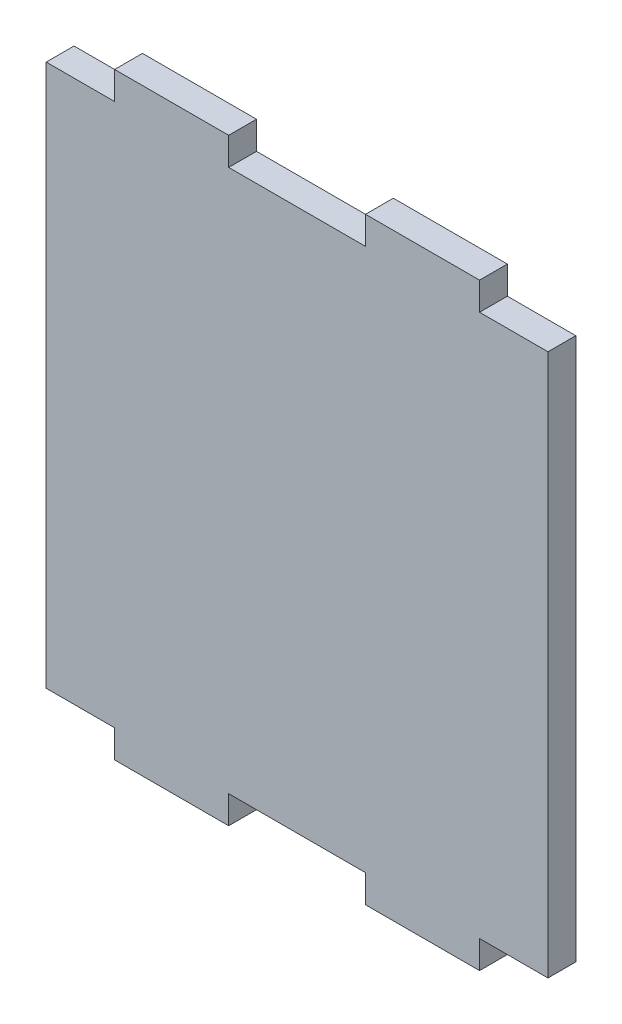
ISO-10303-21;
HEADER;
FILE_DESCRIPTION(('STEP AP214'),'2;1');
FILE_NAME('part.step','',(''),(''),'','','');
FILE_SCHEMA(('AUTOMOTIVE_DESIGN { 1 0 10303 214 1 1 1 1 }'));
ENDSEC;
DATA;
#1=APPLICATION_CONTEXT('core data for automotive mechanical design processes');
#2=APPLICATION_PROTOCOL_DEFINITION('international standard','automotive_design',2000,#1);
#3=PRODUCT_CONTEXT('',#1,'mechanical');
#4=PRODUCT('Part','Part','',(#3));
#5=PRODUCT_RELATED_PRODUCT_CATEGORY('part','',(#4));
#6=PRODUCT_DEFINITION_FORMATION('','',#4);
#7=PRODUCT_DEFINITION_CONTEXT('part definition',#1,'design');
#8=PRODUCT_DEFINITION('design','',#6,#7);
#9=PRODUCT_DEFINITION_SHAPE('','',#8);
#10=(LENGTH_UNIT() NAMED_UNIT(*) SI_UNIT(.MILLI.,.METRE.));
#11=(NAMED_UNIT(*) PLANE_ANGLE_UNIT() SI_UNIT($,.RADIAN.));
#12=(NAMED_UNIT(*) SI_UNIT($,.STERADIAN.) SOLID_ANGLE_UNIT());
#13=UNCERTAINTY_MEASURE_WITH_UNIT(LENGTH_MEASURE(1.E-05),#10,'distance_accuracy_value','');
#14=(GEOMETRIC_REPRESENTATION_CONTEXT(3) GLOBAL_UNCERTAINTY_ASSIGNED_CONTEXT((#13)) GLOBAL_UNIT_ASSIGNED_CONTEXT((#10,
#11,#12)) REPRESENTATION_CONTEXT('',''));
#15=CARTESIAN_POINT('',(0.,0.,0.));
#16=DIRECTION('',(0.,0.,1.));
#17=DIRECTION('',(1.,0.,0.));
#18=AXIS2_PLACEMENT_3D('',#15,#16,#17);
#19=CARTESIAN_POINT('',(16.,23.78,2.44));
#20=DIRECTION('',(0.,-1.,0.));
#21=DIRECTION('',(1.,0.,0.));
#22=AXIS2_PLACEMENT_3D('',#19,#20,#21);
#23=PLANE('',#22);
#24=DIRECTION('',(-1.,0.,0.));
#25=VECTOR('',#24,1.);
#26=CARTESIAN_POINT('',(16.,23.78,0.));
#27=LINE('',#26,#25);
#28=CARTESIAN_POINT('',(22.,23.78,0.));
#29=VERTEX_POINT('',#28);
#30=CARTESIAN_POINT('',(16.,23.78,0.));
#31=VERTEX_POINT('',#30);
#32=EDGE_CURVE('E205',#29,#31,#27,.T.);
#33=ORIENTED_EDGE('',*,*,#32,.T.);
#34=DIRECTION('',(0.,0.,-1.));
#35=VECTOR('',#34,1.);
#36=CARTESIAN_POINT('',(16.,23.78,2.44));
#37=LINE('',#36,#35);
#38=CARTESIAN_POINT('',(16.,23.78,2.44));
#39=VERTEX_POINT('',#38);
#40=EDGE_CURVE('E11',#39,#31,#37,.T.);
#41=ORIENTED_EDGE('',*,*,#40,.F.);
#42=DIRECTION('',(-1.,0.,0.));
#43=VECTOR('',#42,1.);
#44=CARTESIAN_POINT('',(16.,23.78,2.44));
#45=LINE('',#44,#43);
#46=CARTESIAN_POINT('',(22.,23.78,2.44));
#47=VERTEX_POINT('',#46);
#48=EDGE_CURVE('E243',#47,#39,#45,.T.);
#49=ORIENTED_EDGE('',*,*,#48,.F.);
#50=DIRECTION('',(0.,0.,-1.));
#51=VECTOR('',#50,1.);
#52=CARTESIAN_POINT('',(22.,23.78,2.44));
#53=LINE('',#52,#51);
#54=EDGE_CURVE('E201',#47,#29,#53,.T.);
#55=ORIENTED_EDGE('',*,*,#54,.T.);
#56=EDGE_LOOP('',(#33,#41,#49,#55));
#57=FACE_BOUND('',#56,.T.);
#58=ADVANCED_FACE('F37',(#57),#23,.F.);
#59=CARTESIAN_POINT('',(16.,23.78,2.44));
#60=DIRECTION('',(-1.,0.,0.));
#61=DIRECTION('',(0.,0.,1.));
#62=AXIS2_PLACEMENT_3D('',#59,#60,#61);
#63=PLANE('',#62);
#64=DIRECTION('',(0.,1.,0.));
#65=VECTOR('',#64,1.);
#66=CARTESIAN_POINT('',(16.,23.78,0.));
#67=LINE('',#66,#65);
#68=CARTESIAN_POINT('',(16.,26.22,0.));
#69=VERTEX_POINT('',#68);
#70=EDGE_CURVE('E208',#31,#69,#67,.T.);
#71=ORIENTED_EDGE('',*,*,#70,.T.);
#72=DIRECTION('',(0.,0.,-1.));
#73=VECTOR('',#72,1.);
#74=CARTESIAN_POINT('',(16.,26.22,2.44));
#75=LINE('',#74,#73);
#76=CARTESIAN_POINT('',(16.,26.22,2.44));
#77=VERTEX_POINT('',#76);
#78=EDGE_CURVE('E45',#77,#69,#75,.T.);
#79=ORIENTED_EDGE('',*,*,#78,.F.);
#80=DIRECTION('',(0.,1.,0.));
#81=VECTOR('',#80,1.);
#82=CARTESIAN_POINT('',(16.,23.78,2.44));
#83=LINE('',#82,#81);
#84=EDGE_CURVE('E132',#39,#77,#83,.T.);
#85=ORIENTED_EDGE('',*,*,#84,.F.);
#86=ORIENTED_EDGE('',*,*,#40,.T.);
#87=EDGE_LOOP('',(#71,#79,#85,#86));
#88=FACE_BOUND('',#87,.T.);
#89=ADVANCED_FACE('F361',(#88),#63,.F.);
#90=CARTESIAN_POINT('',(6.,26.22,2.44));
#91=DIRECTION('',(0.,-1.,0.));
#92=DIRECTION('',(1.,0.,0.));
#93=AXIS2_PLACEMENT_3D('',#90,#91,#92);
#94=PLANE('',#93);
#95=DIRECTION('',(-1.,0.,0.));
#96=VECTOR('',#95,1.);
#97=CARTESIAN_POINT('',(6.,26.22,0.));
#98=LINE('',#97,#96);
#99=CARTESIAN_POINT('',(6.,26.22,0.));
#100=VERTEX_POINT('',#99);
#101=EDGE_CURVE('E210',#69,#100,#98,.T.);
#102=ORIENTED_EDGE('',*,*,#101,.T.);
#103=DIRECTION('',(0.,0.,-1.));
#104=VECTOR('',#103,1.);
#105=CARTESIAN_POINT('',(6.,26.22,2.44));
#106=LINE('',#105,#104);
#107=CARTESIAN_POINT('',(6.,26.22,2.44));
#108=VERTEX_POINT('',#107);
#109=EDGE_CURVE('E286',#108,#100,#106,.T.);
#110=ORIENTED_EDGE('',*,*,#109,.F.);
#111=DIRECTION('',(-1.,0.,0.));
#112=VECTOR('',#111,1.);
#113=CARTESIAN_POINT('',(6.,26.22,2.44));
#114=LINE('',#113,#112);
#115=EDGE_CURVE('E294',#77,#108,#114,.T.);
#116=ORIENTED_EDGE('',*,*,#115,.F.);
#117=ORIENTED_EDGE('',*,*,#78,.T.);
#118=EDGE_LOOP('',(#102,#110,#116,#117));
#119=FACE_BOUND('',#118,.T.);
#120=ADVANCED_FACE('F292',(#119),#94,.F.);
#121=CARTESIAN_POINT('',(6.,23.78,2.44));
#122=DIRECTION('',(1.,0.,0.));
#123=DIRECTION('',(0.,1.,0.));
#124=AXIS2_PLACEMENT_3D('',#121,#122,#123);
#125=PLANE('',#124);
#126=DIRECTION('',(0.,-1.,0.));
#127=VECTOR('',#126,1.);
#128=CARTESIAN_POINT('',(6.,23.78,0.));
#129=LINE('',#128,#127);
#130=CARTESIAN_POINT('',(6.,23.78,0.));
#131=VERTEX_POINT('',#130);
#132=EDGE_CURVE('E212',#100,#131,#129,.T.);
#133=ORIENTED_EDGE('',*,*,#132,.T.);
#134=DIRECTION('',(0.,0.,-1.));
#135=VECTOR('',#134,1.);
#136=CARTESIAN_POINT('',(6.,23.78,2.44));
#137=LINE('',#136,#135);
#138=CARTESIAN_POINT('',(6.,23.78,2.44));
#139=VERTEX_POINT('',#138);
#140=EDGE_CURVE('E283',#139,#131,#137,.T.);
#141=ORIENTED_EDGE('',*,*,#140,.F.);
#142=DIRECTION('',(0.,-1.,0.));
#143=VECTOR('',#142,1.);
#144=CARTESIAN_POINT('',(6.,23.78,2.44));
#145=LINE('',#144,#143);
#146=EDGE_CURVE('E312',#108,#139,#145,.T.);
#147=ORIENTED_EDGE('',*,*,#146,.F.);
#148=ORIENTED_EDGE('',*,*,#109,.T.);
#149=EDGE_LOOP('',(#133,#141,#147,#148));
#150=FACE_BOUND('',#149,.T.);
#151=ADVANCED_FACE('F303',(#150),#125,.F.);
#152=CARTESIAN_POINT('',(-6.00000000000002,23.78,2.44));
#153=DIRECTION('',(0.,-1.,0.));
#154=DIRECTION('',(0.,0.,-1.));
#155=AXIS2_PLACEMENT_3D('',#152,#153,#154);
#156=PLANE('',#155);
#157=DIRECTION('',(-1.,0.,0.));
#158=VECTOR('',#157,1.);
#159=CARTESIAN_POINT('',(-6.00000000000002,23.78,0.));
#160=LINE('',#159,#158);
#161=CARTESIAN_POINT('',(-6.00000000000002,23.78,0.));
#162=VERTEX_POINT('',#161);
#163=EDGE_CURVE('E214',#131,#162,#160,.T.);
#164=ORIENTED_EDGE('',*,*,#163,.T.);
#165=DIRECTION('',(0.,0.,-1.));
#166=VECTOR('',#165,1.);
#167=CARTESIAN_POINT('',(-6.00000000000002,23.78,2.44));
#168=LINE('',#167,#166);
#169=CARTESIAN_POINT('',(-6.00000000000002,23.78,2.44));
#170=VERTEX_POINT('',#169);
#171=EDGE_CURVE('E280',#170,#162,#168,.T.);
#172=ORIENTED_EDGE('',*,*,#171,.F.);
#173=DIRECTION('',(-1.,0.,0.));
#174=VECTOR('',#173,1.);
#175=CARTESIAN_POINT('',(-6.00000000000002,23.78,2.44));
#176=LINE('',#175,#174);
#177=EDGE_CURVE('E309',#139,#170,#176,.T.);
#178=ORIENTED_EDGE('',*,*,#177,.F.);
#179=ORIENTED_EDGE('',*,*,#140,.T.);
#180=EDGE_LOOP('',(#164,#172,#178,#179));
#181=FACE_BOUND('',#180,.T.);
#182=ADVANCED_FACE('F307',(#181),#156,.F.);
#183=CARTESIAN_POINT('',(-6.00000000000002,23.78,2.44));
#184=DIRECTION('',(-1.,0.,0.));
#185=DIRECTION('',(0.,-1.,0.));
#186=AXIS2_PLACEMENT_3D('',#183,#184,#185);
#187=PLANE('',#186);
#188=DIRECTION('',(0.,1.,0.));
#189=VECTOR('',#188,1.);
#190=CARTESIAN_POINT('',(-6.00000000000002,23.78,0.));
#191=LINE('',#190,#189);
#192=CARTESIAN_POINT('',(-6.00000000000002,26.22,0.));
#193=VERTEX_POINT('',#192);
#194=EDGE_CURVE('E216',#162,#193,#191,.T.);
#195=ORIENTED_EDGE('',*,*,#194,.T.);
#196=DIRECTION('',(0.,0.,-1.));
#197=VECTOR('',#196,1.);
#198=CARTESIAN_POINT('',(-6.00000000000002,26.22,2.44));
#199=LINE('',#198,#197);
#200=CARTESIAN_POINT('',(-6.00000000000002,26.22,2.44));
#201=VERTEX_POINT('',#200);
#202=EDGE_CURVE('E277',#201,#193,#199,.T.);
#203=ORIENTED_EDGE('',*,*,#202,.F.);
#204=DIRECTION('',(0.,1.,0.));
#205=VECTOR('',#204,1.);
#206=CARTESIAN_POINT('',(-6.00000000000002,23.78,2.44));
#207=LINE('',#206,#205);
#208=EDGE_CURVE('E311',#170,#201,#207,.T.);
#209=ORIENTED_EDGE('',*,*,#208,.F.);
#210=ORIENTED_EDGE('',*,*,#171,.T.);
#211=EDGE_LOOP('',(#195,#203,#209,#210));
#212=FACE_BOUND('',#211,.T.);
#213=ADVANCED_FACE('F374',(#212),#187,.F.);
#214=CARTESIAN_POINT('',(-6.00000000000002,26.22,2.44));
#215=DIRECTION('',(0.,-1.,0.));
#216=DIRECTION('',(1.,0.,0.));
#217=AXIS2_PLACEMENT_3D('',#214,#215,#216);
#218=PLANE('',#217);
#219=DIRECTION('',(-1.,0.,0.));
#220=VECTOR('',#219,1.);
#221=CARTESIAN_POINT('',(-6.00000000000002,26.22,0.));
#222=LINE('',#221,#220);
#223=CARTESIAN_POINT('',(-16.,26.22,0.));
#224=VERTEX_POINT('',#223);
#225=EDGE_CURVE('E218',#193,#224,#222,.T.);
#226=ORIENTED_EDGE('',*,*,#225,.T.);
#227=DIRECTION('',(0.,0.,-1.));
#228=VECTOR('',#227,1.);
#229=CARTESIAN_POINT('',(-16.,26.22,2.44));
#230=LINE('',#229,#228);
#231=CARTESIAN_POINT('',(-16.,26.22,2.44));
#232=VERTEX_POINT('',#231);
#233=EDGE_CURVE('E274',#232,#224,#230,.T.);
#234=ORIENTED_EDGE('',*,*,#233,.F.);
#235=DIRECTION('',(-1.,0.,0.));
#236=VECTOR('',#235,1.);
#237=CARTESIAN_POINT('',(-6.00000000000002,26.22,2.44));
#238=LINE('',#237,#236);
#239=EDGE_CURVE('E314',#201,#232,#238,.T.);
#240=ORIENTED_EDGE('',*,*,#239,.F.);
#241=ORIENTED_EDGE('',*,*,#202,.T.);
#242=EDGE_LOOP('',(#226,#234,#240,#241));
#243=FACE_BOUND('',#242,.T.);
#244=ADVANCED_FACE('F377',(#243),#218,.F.);
#245=CARTESIAN_POINT('',(-16.,23.78,2.44));
#246=DIRECTION('',(1.,0.,0.));
#247=DIRECTION('',(0.,0.,-1.));
#248=AXIS2_PLACEMENT_3D('',#245,#246,#247);
#249=PLANE('',#248);
#250=DIRECTION('',(0.,-1.,0.));
#251=VECTOR('',#250,1.);
#252=CARTESIAN_POINT('',(-16.,23.78,0.));
#253=LINE('',#252,#251);
#254=CARTESIAN_POINT('',(-16.,23.78,0.));
#255=VERTEX_POINT('',#254);
#256=EDGE_CURVE('E220',#224,#255,#253,.T.);
#257=ORIENTED_EDGE('',*,*,#256,.T.);
#258=DIRECTION('',(0.,0.,-1.));
#259=VECTOR('',#258,1.);
#260=CARTESIAN_POINT('',(-16.,23.78,2.44));
#261=LINE('',#260,#259);
#262=CARTESIAN_POINT('',(-16.,23.78,2.44));
#263=VERTEX_POINT('',#262);
#264=EDGE_CURVE('E271',#263,#255,#261,.T.);
#265=ORIENTED_EDGE('',*,*,#264,.F.);
#266=DIRECTION('',(0.,-1.,0.));
#267=VECTOR('',#266,1.);
#268=CARTESIAN_POINT('',(-16.,23.78,2.44));
#269=LINE('',#268,#267);
#270=EDGE_CURVE('E320',#232,#263,#269,.T.);
#271=ORIENTED_EDGE('',*,*,#270,.F.);
#272=ORIENTED_EDGE('',*,*,#233,.T.);
#273=EDGE_LOOP('',(#257,#265,#271,#272));
#274=FACE_BOUND('',#273,.T.);
#275=ADVANCED_FACE('F381',(#274),#249,.F.);
#276=CARTESIAN_POINT('',(-22.,23.78,2.44));
#277=DIRECTION('',(0.,-1.,0.));
#278=DIRECTION('',(1.,0.,0.));
#279=AXIS2_PLACEMENT_3D('',#276,#277,#278);
#280=PLANE('',#279);
#281=DIRECTION('',(-1.,0.,0.));
#282=VECTOR('',#281,1.);
#283=CARTESIAN_POINT('',(-22.,23.78,0.));
#284=LINE('',#283,#282);
#285=CARTESIAN_POINT('',(-22.,23.78,0.));
#286=VERTEX_POINT('',#285);
#287=EDGE_CURVE('E222',#255,#286,#284,.T.);
#288=ORIENTED_EDGE('',*,*,#287,.T.);
#289=DIRECTION('',(0.,0.,-1.));
#290=VECTOR('',#289,1.);
#291=CARTESIAN_POINT('',(-22.,23.78,2.44));
#292=LINE('',#291,#290);
#293=CARTESIAN_POINT('',(-22.,23.78,2.44));
#294=VERTEX_POINT('',#293);
#295=EDGE_CURVE('E268',#294,#286,#292,.T.);
#296=ORIENTED_EDGE('',*,*,#295,.F.);
#297=DIRECTION('',(-1.,0.,0.));
#298=VECTOR('',#297,1.);
#299=CARTESIAN_POINT('',(-22.,23.78,2.44));
#300=LINE('',#299,#298);
#301=EDGE_CURVE('E322',#263,#294,#300,.T.);
#302=ORIENTED_EDGE('',*,*,#301,.F.);
#303=ORIENTED_EDGE('',*,*,#264,.T.);
#304=EDGE_LOOP('',(#288,#296,#302,#303));
#305=FACE_BOUND('',#304,.T.);
#306=ADVANCED_FACE('F385',(#305),#280,.F.);
#307=CARTESIAN_POINT('',(-22.,-23.78,2.44));
#308=DIRECTION('',(1.,0.,0.));
#309=DIRECTION('',(0.,0.,-1.));
#310=AXIS2_PLACEMENT_3D('',#307,#308,#309);
#311=PLANE('',#310);
#312=DIRECTION('',(0.,-1.,0.));
#313=VECTOR('',#312,1.);
#314=CARTESIAN_POINT('',(-22.,-23.78,0.));
#315=LINE('',#314,#313);
#316=CARTESIAN_POINT('',(-22.,-23.78,0.));
#317=VERTEX_POINT('',#316);
#318=EDGE_CURVE('E224',#286,#317,#315,.T.);
#319=ORIENTED_EDGE('',*,*,#318,.T.);
#320=DIRECTION('',(0.,0.,-1.));
#321=VECTOR('',#320,1.);
#322=CARTESIAN_POINT('',(-22.,-23.78,2.44));
#323=LINE('',#322,#321);
#324=CARTESIAN_POINT('',(-22.,-23.78,2.44));
#325=VERTEX_POINT('',#324);
#326=EDGE_CURVE('E265',#325,#317,#323,.T.);
#327=ORIENTED_EDGE('',*,*,#326,.F.);
#328=DIRECTION('',(0.,-1.,0.));
#329=VECTOR('',#328,1.);
#330=CARTESIAN_POINT('',(-22.,-23.78,2.44));
#331=LINE('',#330,#329);
#332=EDGE_CURVE('E324',#294,#325,#331,.T.);
#333=ORIENTED_EDGE('',*,*,#332,.F.);
#334=ORIENTED_EDGE('',*,*,#295,.T.);
#335=EDGE_LOOP('',(#319,#327,#333,#334));
#336=FACE_BOUND('',#335,.T.);
#337=ADVANCED_FACE('F389',(#336),#311,.F.);
#338=CARTESIAN_POINT('',(-22.,-23.78,2.44));
#339=DIRECTION('',(0.,1.,0.));
#340=DIRECTION('',(0.,0.,1.));
#341=AXIS2_PLACEMENT_3D('',#338,#339,#340);
#342=PLANE('',#341);
#343=DIRECTION('',(1.,0.,0.));
#344=VECTOR('',#343,1.);
#345=CARTESIAN_POINT('',(-22.,-23.78,0.));
#346=LINE('',#345,#344);
#347=CARTESIAN_POINT('',(-16.,-23.78,0.));
#348=VERTEX_POINT('',#347);
#349=EDGE_CURVE('E226',#317,#348,#346,.T.);
#350=ORIENTED_EDGE('',*,*,#349,.T.);
#351=DIRECTION('',(0.,0.,-1.));
#352=VECTOR('',#351,1.);
#353=CARTESIAN_POINT('',(-16.,-23.78,2.44));
#354=LINE('',#353,#352);
#355=CARTESIAN_POINT('',(-16.,-23.78,2.44));
#356=VERTEX_POINT('',#355);
#357=EDGE_CURVE('E262',#356,#348,#354,.T.);
#358=ORIENTED_EDGE('',*,*,#357,.F.);
#359=DIRECTION('',(1.,0.,0.));
#360=VECTOR('',#359,1.);
#361=CARTESIAN_POINT('',(-22.,-23.78,2.44));
#362=LINE('',#361,#360);
#363=EDGE_CURVE('E326',#325,#356,#362,.T.);
#364=ORIENTED_EDGE('',*,*,#363,.F.);
#365=ORIENTED_EDGE('',*,*,#326,.T.);
#366=EDGE_LOOP('',(#350,#358,#364,#365));
#367=FACE_BOUND('',#366,.T.);
#368=ADVANCED_FACE('F393',(#367),#342,.F.);
#369=CARTESIAN_POINT('',(-16.,-23.78,2.44));
#370=DIRECTION('',(1.,0.,0.));
#371=DIRECTION('',(0.,0.,-1.));
#372=AXIS2_PLACEMENT_3D('',#369,#370,#371);
#373=PLANE('',#372);
#374=DIRECTION('',(0.,-1.,0.));
#375=VECTOR('',#374,1.);
#376=CARTESIAN_POINT('',(-16.,-23.78,0.));
#377=LINE('',#376,#375);
#378=CARTESIAN_POINT('',(-16.,-26.22,0.));
#379=VERTEX_POINT('',#378);
#380=EDGE_CURVE('E228',#348,#379,#377,.T.);
#381=ORIENTED_EDGE('',*,*,#380,.T.);
#382=DIRECTION('',(0.,0.,-1.));
#383=VECTOR('',#382,1.);
#384=CARTESIAN_POINT('',(-16.,-26.22,2.44));
#385=LINE('',#384,#383);
#386=CARTESIAN_POINT('',(-16.,-26.22,2.44));
#387=VERTEX_POINT('',#386);
#388=EDGE_CURVE('E259',#387,#379,#385,.T.);
#389=ORIENTED_EDGE('',*,*,#388,.F.);
#390=DIRECTION('',(0.,-1.,0.));
#391=VECTOR('',#390,1.);
#392=CARTESIAN_POINT('',(-16.,-23.78,2.44));
#393=LINE('',#392,#391);
#394=EDGE_CURVE('E328',#356,#387,#393,.T.);
#395=ORIENTED_EDGE('',*,*,#394,.F.);
#396=ORIENTED_EDGE('',*,*,#357,.T.);
#397=EDGE_LOOP('',(#381,#389,#395,#396));
#398=FACE_BOUND('',#397,.T.);
#399=ADVANCED_FACE('F397',(#398),#373,.F.);
#400=CARTESIAN_POINT('',(-6.00000000000002,-26.22,2.44));
#401=DIRECTION('',(0.,1.,0.));
#402=DIRECTION('',(-1.,0.,0.));
#403=AXIS2_PLACEMENT_3D('',#400,#401,#402);
#404=PLANE('',#403);
#405=DIRECTION('',(1.,0.,0.));
#406=VECTOR('',#405,1.);
#407=CARTESIAN_POINT('',(-6.00000000000002,-26.22,0.));
#408=LINE('',#407,#406);
#409=CARTESIAN_POINT('',(-6.00000000000002,-26.22,0.));
#410=VERTEX_POINT('',#409);
#411=EDGE_CURVE('E230',#379,#410,#408,.T.);
#412=ORIENTED_EDGE('',*,*,#411,.T.);
#413=DIRECTION('',(0.,0.,-1.));
#414=VECTOR('',#413,1.);
#415=CARTESIAN_POINT('',(-6.00000000000002,-26.22,2.44));
#416=LINE('',#415,#414);
#417=CARTESIAN_POINT('',(-6.00000000000002,-26.22,2.44));
#418=VERTEX_POINT('',#417);
#419=EDGE_CURVE('E256',#418,#410,#416,.T.);
#420=ORIENTED_EDGE('',*,*,#419,.F.);
#421=DIRECTION('',(1.,0.,0.));
#422=VECTOR('',#421,1.);
#423=CARTESIAN_POINT('',(-6.00000000000002,-26.22,2.44));
#424=LINE('',#423,#422);
#425=EDGE_CURVE('E330',#387,#418,#424,.T.);
#426=ORIENTED_EDGE('',*,*,#425,.F.);
#427=ORIENTED_EDGE('',*,*,#388,.T.);
#428=EDGE_LOOP('',(#412,#420,#426,#427));
#429=FACE_BOUND('',#428,.T.);
#430=ADVANCED_FACE('F401',(#429),#404,.F.);
#431=CARTESIAN_POINT('',(-6.00000000000002,-23.78,2.44));
#432=DIRECTION('',(-1.,0.,0.));
#433=DIRECTION('',(0.,-1.,0.));
#434=AXIS2_PLACEMENT_3D('',#431,#432,#433);
#435=PLANE('',#434);
#436=DIRECTION('',(0.,1.,0.));
#437=VECTOR('',#436,1.);
#438=CARTESIAN_POINT('',(-6.00000000000002,-23.78,0.));
#439=LINE('',#438,#437);
#440=CARTESIAN_POINT('',(-6.00000000000002,-23.78,0.));
#441=VERTEX_POINT('',#440);
#442=EDGE_CURVE('E232',#410,#441,#439,.T.);
#443=ORIENTED_EDGE('',*,*,#442,.T.);
#444=DIRECTION('',(0.,0.,-1.));
#445=VECTOR('',#444,1.);
#446=CARTESIAN_POINT('',(-6.00000000000002,-23.78,2.44));
#447=LINE('',#446,#445);
#448=CARTESIAN_POINT('',(-6.00000000000002,-23.78,2.44));
#449=VERTEX_POINT('',#448);
#450=EDGE_CURVE('E253',#449,#441,#447,.T.);
#451=ORIENTED_EDGE('',*,*,#450,.F.);
#452=DIRECTION('',(0.,1.,0.));
#453=VECTOR('',#452,1.);
#454=CARTESIAN_POINT('',(-6.00000000000002,-23.78,2.44));
#455=LINE('',#454,#453);
#456=EDGE_CURVE('E332',#418,#449,#455,.T.);
#457=ORIENTED_EDGE('',*,*,#456,.F.);
#458=ORIENTED_EDGE('',*,*,#419,.T.);
#459=EDGE_LOOP('',(#443,#451,#457,#458));
#460=FACE_BOUND('',#459,.T.);
#461=ADVANCED_FACE('F405',(#460),#435,.F.);
#462=CARTESIAN_POINT('',(-6.00000000000002,-23.78,2.44));
#463=DIRECTION('',(0.,1.,0.));
#464=DIRECTION('',(0.,0.,1.));
#465=AXIS2_PLACEMENT_3D('',#462,#463,#464);
#466=PLANE('',#465);
#467=DIRECTION('',(1.,0.,0.));
#468=VECTOR('',#467,1.);
#469=CARTESIAN_POINT('',(-6.00000000000002,-23.78,0.));
#470=LINE('',#469,#468);
#471=CARTESIAN_POINT('',(6.,-23.78,0.));
#472=VERTEX_POINT('',#471);
#473=EDGE_CURVE('E234',#441,#472,#470,.T.);
#474=ORIENTED_EDGE('',*,*,#473,.T.);
#475=DIRECTION('',(0.,0.,-1.));
#476=VECTOR('',#475,1.);
#477=CARTESIAN_POINT('',(6.,-23.78,2.44));
#478=LINE('',#477,#476);
#479=CARTESIAN_POINT('',(6.,-23.78,2.44));
#480=VERTEX_POINT('',#479);
#481=EDGE_CURVE('E250',#480,#472,#478,.T.);
#482=ORIENTED_EDGE('',*,*,#481,.F.);
#483=DIRECTION('',(1.,0.,0.));
#484=VECTOR('',#483,1.);
#485=CARTESIAN_POINT('',(-6.00000000000002,-23.78,2.44));
#486=LINE('',#485,#484);
#487=EDGE_CURVE('E334',#449,#480,#486,.T.);
#488=ORIENTED_EDGE('',*,*,#487,.F.);
#489=ORIENTED_EDGE('',*,*,#450,.T.);
#490=EDGE_LOOP('',(#474,#482,#488,#489));
#491=FACE_BOUND('',#490,.T.);
#492=ADVANCED_FACE('F409',(#491),#466,.F.);
#493=CARTESIAN_POINT('',(6.,-23.78,2.44));
#494=DIRECTION('',(1.,0.,0.));
#495=DIRECTION('',(0.,1.,0.));
#496=AXIS2_PLACEMENT_3D('',#493,#494,#495);
#497=PLANE('',#496);
#498=DIRECTION('',(0.,-1.,0.));
#499=VECTOR('',#498,1.);
#500=CARTESIAN_POINT('',(6.,-23.78,0.));
#501=LINE('',#500,#499);
#502=CARTESIAN_POINT('',(6.,-26.22,0.));
#503=VERTEX_POINT('',#502);
#504=EDGE_CURVE('E236',#472,#503,#501,.T.);
#505=ORIENTED_EDGE('',*,*,#504,.T.);
#506=DIRECTION('',(0.,0.,-1.));
#507=VECTOR('',#506,1.);
#508=CARTESIAN_POINT('',(6.,-26.22,2.44));
#509=LINE('',#508,#507);
#510=CARTESIAN_POINT('',(6.,-26.22,2.44));
#511=VERTEX_POINT('',#510);
#512=EDGE_CURVE('E247',#511,#503,#509,.T.);
#513=ORIENTED_EDGE('',*,*,#512,.F.);
#514=DIRECTION('',(0.,-1.,0.));
#515=VECTOR('',#514,1.);
#516=CARTESIAN_POINT('',(6.,-23.78,2.44));
#517=LINE('',#516,#515);
#518=EDGE_CURVE('E336',#480,#511,#517,.T.);
#519=ORIENTED_EDGE('',*,*,#518,.F.);
#520=ORIENTED_EDGE('',*,*,#481,.T.);
#521=EDGE_LOOP('',(#505,#513,#519,#520));
#522=FACE_BOUND('',#521,.T.);
#523=ADVANCED_FACE('F342',(#522),#497,.F.);
#524=CARTESIAN_POINT('',(6.,-26.22,2.44));
#525=DIRECTION('',(0.,1.,0.));
#526=DIRECTION('',(-1.,0.,0.));
#527=AXIS2_PLACEMENT_3D('',#524,#525,#526);
#528=PLANE('',#527);
#529=DIRECTION('',(1.,0.,0.));
#530=VECTOR('',#529,1.);
#531=CARTESIAN_POINT('',(6.,-26.22,0.));
#532=LINE('',#531,#530);
#533=CARTESIAN_POINT('',(16.,-26.22,0.));
#534=VERTEX_POINT('',#533);
#535=EDGE_CURVE('E238',#503,#534,#532,.T.);
#536=ORIENTED_EDGE('',*,*,#535,.T.);
#537=DIRECTION('',(0.,0.,-1.));
#538=VECTOR('',#537,1.);
#539=CARTESIAN_POINT('',(16.,-26.22,2.44));
#540=LINE('',#539,#538);
#541=CARTESIAN_POINT('',(16.,-26.22,2.44));
#542=VERTEX_POINT('',#541);
#543=EDGE_CURVE('E196',#542,#534,#540,.T.);
#544=ORIENTED_EDGE('',*,*,#543,.F.);
#545=DIRECTION('',(1.,0.,0.));
#546=VECTOR('',#545,1.);
#547=CARTESIAN_POINT('',(6.,-26.22,2.44));
#548=LINE('',#547,#546);
#549=EDGE_CURVE('E187',#511,#542,#548,.T.);
#550=ORIENTED_EDGE('',*,*,#549,.F.);
#551=ORIENTED_EDGE('',*,*,#512,.T.);
#552=EDGE_LOOP('',(#536,#544,#550,#551));
#553=FACE_BOUND('',#552,.T.);
#554=ADVANCED_FACE('F346',(#553),#528,.F.);
#555=CARTESIAN_POINT('',(16.,-23.78,2.44));
#556=DIRECTION('',(-1.,0.,0.));
#557=DIRECTION('',(0.,0.,1.));
#558=AXIS2_PLACEMENT_3D('',#555,#556,#557);
#559=PLANE('',#558);
#560=DIRECTION('',(0.,1.,0.));
#561=VECTOR('',#560,1.);
#562=CARTESIAN_POINT('',(16.,-23.78,0.));
#563=LINE('',#562,#561);
#564=CARTESIAN_POINT('',(16.,-23.78,0.));
#565=VERTEX_POINT('',#564);
#566=EDGE_CURVE('E195',#534,#565,#563,.T.);
#567=ORIENTED_EDGE('',*,*,#566,.T.);
#568=DIRECTION('',(0.,0.,-1.));
#569=VECTOR('',#568,1.);
#570=CARTESIAN_POINT('',(16.,-23.78,2.44));
#571=LINE('',#570,#569);
#572=CARTESIAN_POINT('',(16.,-23.78,2.44));
#573=VERTEX_POINT('',#572);
#574=EDGE_CURVE('E192',#573,#565,#571,.T.);
#575=ORIENTED_EDGE('',*,*,#574,.F.);
#576=DIRECTION('',(0.,1.,0.));
#577=VECTOR('',#576,1.);
#578=CARTESIAN_POINT('',(16.,-23.78,2.44));
#579=LINE('',#578,#577);
#580=EDGE_CURVE('E181',#542,#573,#579,.T.);
#581=ORIENTED_EDGE('',*,*,#580,.F.);
#582=ORIENTED_EDGE('',*,*,#543,.T.);
#583=EDGE_LOOP('',(#567,#575,#581,#582));
#584=FACE_BOUND('',#583,.T.);
#585=ADVANCED_FACE('F193',(#584),#559,.F.);
#586=CARTESIAN_POINT('',(16.,-23.78,2.44));
#587=DIRECTION('',(0.,1.,0.));
#588=DIRECTION('',(0.,0.,1.));
#589=AXIS2_PLACEMENT_3D('',#586,#587,#588);
#590=PLANE('',#589);
#591=DIRECTION('',(1.,0.,0.));
#592=VECTOR('',#591,1.);
#593=CARTESIAN_POINT('',(16.,-23.78,0.));
#594=LINE('',#593,#592);
#595=CARTESIAN_POINT('',(22.,-23.78,0.));
#596=VERTEX_POINT('',#595);
#597=EDGE_CURVE('E118',#565,#596,#594,.T.);
#598=ORIENTED_EDGE('',*,*,#597,.T.);
#599=DIRECTION('',(0.,0.,-1.));
#600=VECTOR('',#599,1.);
#601=CARTESIAN_POINT('',(22.,-23.78,2.44));
#602=LINE('',#601,#600);
#603=CARTESIAN_POINT('',(22.,-23.78,2.44));
#604=VERTEX_POINT('',#603);
#605=EDGE_CURVE('E197',#604,#596,#602,.T.);
#606=ORIENTED_EDGE('',*,*,#605,.F.);
#607=DIRECTION('',(1.,0.,0.));
#608=VECTOR('',#607,1.);
#609=CARTESIAN_POINT('',(16.,-23.78,2.44));
#610=LINE('',#609,#608);
#611=EDGE_CURVE('E185',#573,#604,#610,.T.);
#612=ORIENTED_EDGE('',*,*,#611,.F.);
#613=ORIENTED_EDGE('',*,*,#574,.T.);
#614=EDGE_LOOP('',(#598,#606,#612,#613));
#615=FACE_BOUND('',#614,.T.);
#616=ADVANCED_FACE('F199',(#615),#590,.F.);
#617=CARTESIAN_POINT('',(22.,-23.78,2.44));
#618=DIRECTION('',(-1.,0.,0.));
#619=DIRECTION('',(0.,0.,1.));
#620=AXIS2_PLACEMENT_3D('',#617,#618,#619);
#621=PLANE('',#620);
#622=DIRECTION('',(0.,1.,0.));
#623=VECTOR('',#622,1.);
#624=CARTESIAN_POINT('',(22.,-23.78,0.));
#625=LINE('',#624,#623);
#626=EDGE_CURVE('E124',#596,#29,#625,.T.);
#627=ORIENTED_EDGE('',*,*,#626,.T.);
#628=ORIENTED_EDGE('',*,*,#54,.F.);
#629=DIRECTION('',(0.,1.,0.));
#630=VECTOR('',#629,1.);
#631=CARTESIAN_POINT('',(22.,-23.78,2.44));
#632=LINE('',#631,#630);
#633=EDGE_CURVE('E53',#604,#47,#632,.T.);
#634=ORIENTED_EDGE('',*,*,#633,.F.);
#635=ORIENTED_EDGE('',*,*,#605,.T.);
#636=EDGE_LOOP('',(#627,#628,#634,#635));
#637=FACE_BOUND('',#636,.T.);
#638=ADVANCED_FACE('F350',(#637),#621,.F.);
#639=CARTESIAN_POINT('',(0.,0.,2.44));
#640=DIRECTION('',(0.,0.,1.));
#641=DIRECTION('',(1.,0.,0.));
#642=AXIS2_PLACEMENT_3D('',#639,#640,#641);
#643=PLANE('',#642);
#644=ORIENTED_EDGE('',*,*,#48,.T.);
#645=ORIENTED_EDGE('',*,*,#84,.T.);
#646=ORIENTED_EDGE('',*,*,#115,.T.);
#647=ORIENTED_EDGE('',*,*,#146,.T.);
#648=ORIENTED_EDGE('',*,*,#177,.T.);
#649=ORIENTED_EDGE('',*,*,#208,.T.);
#650=ORIENTED_EDGE('',*,*,#239,.T.);
#651=ORIENTED_EDGE('',*,*,#270,.T.);
#652=ORIENTED_EDGE('',*,*,#301,.T.);
#653=ORIENTED_EDGE('',*,*,#332,.T.);
#654=ORIENTED_EDGE('',*,*,#363,.T.);
#655=ORIENTED_EDGE('',*,*,#394,.T.);
#656=ORIENTED_EDGE('',*,*,#425,.T.);
#657=ORIENTED_EDGE('',*,*,#456,.T.);
#658=ORIENTED_EDGE('',*,*,#487,.T.);
#659=ORIENTED_EDGE('',*,*,#518,.T.);
#660=ORIENTED_EDGE('',*,*,#549,.T.);
#661=ORIENTED_EDGE('',*,*,#580,.T.);
#662=ORIENTED_EDGE('',*,*,#611,.T.);
#663=ORIENTED_EDGE('',*,*,#633,.T.);
#664=EDGE_LOOP('',(#644,#645,#646,#647,#648,#649,#650,#651,#652,#653,#654,#655,#656,#657,#658,
#659,#660,#661,#662,#663));
#665=FACE_BOUND('',#664,.T.);
#666=ADVANCED_FACE('F183',(#665),#643,.T.);
#667=CARTESIAN_POINT('',(0.,0.,0.));
#668=DIRECTION('',(0.,0.,1.));
#669=DIRECTION('',(1.,0.,0.));
#670=AXIS2_PLACEMENT_3D('',#667,#668,#669);
#671=PLANE('',#670);
#672=ORIENTED_EDGE('',*,*,#32,.F.);
#673=ORIENTED_EDGE('',*,*,#626,.F.);
#674=ORIENTED_EDGE('',*,*,#597,.F.);
#675=ORIENTED_EDGE('',*,*,#566,.F.);
#676=ORIENTED_EDGE('',*,*,#535,.F.);
#677=ORIENTED_EDGE('',*,*,#504,.F.);
#678=ORIENTED_EDGE('',*,*,#473,.F.);
#679=ORIENTED_EDGE('',*,*,#442,.F.);
#680=ORIENTED_EDGE('',*,*,#411,.F.);
#681=ORIENTED_EDGE('',*,*,#380,.F.);
#682=ORIENTED_EDGE('',*,*,#349,.F.);
#683=ORIENTED_EDGE('',*,*,#318,.F.);
#684=ORIENTED_EDGE('',*,*,#287,.F.);
#685=ORIENTED_EDGE('',*,*,#256,.F.);
#686=ORIENTED_EDGE('',*,*,#225,.F.);
#687=ORIENTED_EDGE('',*,*,#194,.F.);
#688=ORIENTED_EDGE('',*,*,#163,.F.);
#689=ORIENTED_EDGE('',*,*,#132,.F.);
#690=ORIENTED_EDGE('',*,*,#101,.F.);
#691=ORIENTED_EDGE('',*,*,#70,.F.);
#692=EDGE_LOOP('',(#672,#673,#674,#675,#676,#677,#678,#679,#680,#681,#682,#683,#684,#685,#686,
#687,#688,#689,#690,#691));
#693=FACE_BOUND('',#692,.T.);
#694=ADVANCED_FACE('F298',(#693),#671,.F.);
#695=CLOSED_SHELL('',(#58,#89,#120,#151,#182,#213,#244,#275,#306,#337,#368,#399,#430,#461,#492,
#523,#554,#585,#616,#638,#666,#694));
#696=MANIFOLD_SOLID_BREP('B2',#695);
#697=ADVANCED_BREP_SHAPE_REPRESENTATION('',(#18,#696),#14);
#698=SHAPE_DEFINITION_REPRESENTATION(#9,#697);
ENDSEC;
END-ISO-10303-21;
